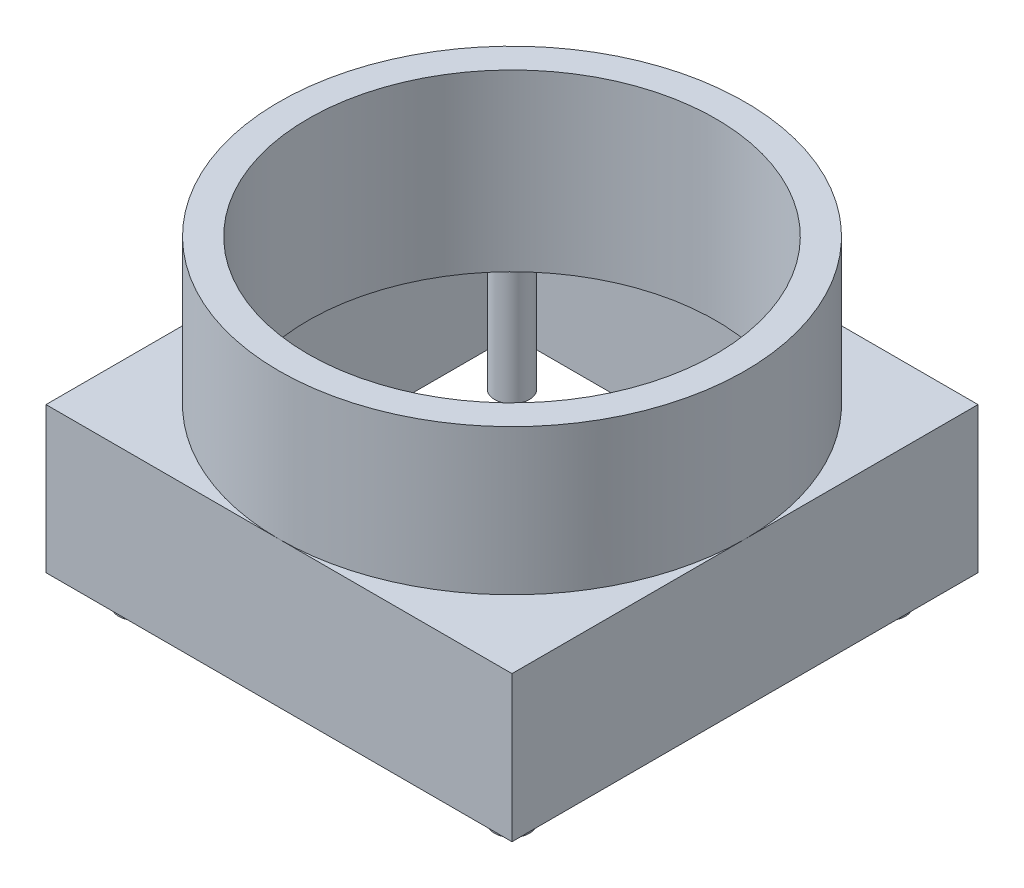
ISO-10303-21;
HEADER;
FILE_DESCRIPTION(('STEP AP214'),'2;1');
FILE_NAME('part.step','',(''),(''),'','','');
FILE_SCHEMA(('AUTOMOTIVE_DESIGN { 1 0 10303 214 1 1 1 1 }'));
ENDSEC;
DATA;
#1=APPLICATION_CONTEXT('core data for automotive mechanical design processes');
#2=APPLICATION_PROTOCOL_DEFINITION('international standard','automotive_design',2000,#1);
#3=PRODUCT_CONTEXT('',#1,'mechanical');
#4=PRODUCT('Part','Part','',(#3));
#5=PRODUCT_RELATED_PRODUCT_CATEGORY('part','',(#4));
#6=PRODUCT_DEFINITION_FORMATION('','',#4);
#7=PRODUCT_DEFINITION_CONTEXT('part definition',#1,'design');
#8=PRODUCT_DEFINITION('design','',#6,#7);
#9=PRODUCT_DEFINITION_SHAPE('','',#8);
#10=(LENGTH_UNIT() NAMED_UNIT(*) SI_UNIT(.MILLI.,.METRE.));
#11=(NAMED_UNIT(*) PLANE_ANGLE_UNIT() SI_UNIT($,.RADIAN.));
#12=(NAMED_UNIT(*) SI_UNIT($,.STERADIAN.) SOLID_ANGLE_UNIT());
#13=UNCERTAINTY_MEASURE_WITH_UNIT(LENGTH_MEASURE(1.E-05),#10,'distance_accuracy_value','');
#14=(GEOMETRIC_REPRESENTATION_CONTEXT(3) GLOBAL_UNCERTAINTY_ASSIGNED_CONTEXT((#13)) GLOBAL_UNIT_ASSIGNED_CONTEXT((#10,
#11,#12)) REPRESENTATION_CONTEXT('',''));
#15=CARTESIAN_POINT('',(0.,0.,0.));
#16=DIRECTION('',(0.,0.,1.));
#17=DIRECTION('',(1.,0.,0.));
#18=AXIS2_PLACEMENT_3D('',#15,#16,#17);
#19=CARTESIAN_POINT('',(-3.225,-0.5,-3.225));
#20=DIRECTION('',(0.,1.,0.));
#21=DIRECTION('',(0.,0.,1.));
#22=AXIS2_PLACEMENT_3D('',#19,#20,#21);
#23=CYLINDRICAL_SURFACE('',#22,0.3);
#24=CARTESIAN_POINT('',(-3.225,-0.5,-3.225));
#25=DIRECTION('',(0.,-1.,0.));
#26=DIRECTION('',(0.,0.,-1.));
#27=AXIS2_PLACEMENT_3D('',#24,#25,#26);
#28=CIRCLE('',#27,0.3);
#29=CARTESIAN_POINT('',(-3.225,-0.5,-3.525));
#30=VERTEX_POINT('',#29);
#31=EDGE_CURVE('E124',#30,#30,#28,.T.);
#32=ORIENTED_EDGE('',*,*,#31,.F.);
#33=EDGE_LOOP('',(#32));
#34=FACE_BOUND('',#33,.T.);
#35=CARTESIAN_POINT('',(-3.225,2.,-3.225));
#36=DIRECTION('',(0.,-1.,0.));
#37=DIRECTION('',(0.,0.,-1.));
#38=AXIS2_PLACEMENT_3D('',#35,#36,#37);
#39=CIRCLE('',#38,0.3);
#40=CARTESIAN_POINT('',(-3.225,2.,-3.525));
#41=VERTEX_POINT('',#40);
#42=EDGE_CURVE('E12',#41,#41,#39,.T.);
#43=ORIENTED_EDGE('',*,*,#42,.T.);
#44=EDGE_LOOP('',(#43));
#45=FACE_BOUND('',#44,.T.);
#46=ADVANCED_FACE('F120',(#34,#45),#23,.T.);
#47=CARTESIAN_POINT('',(-3.225,-0.5,-3.225));
#48=DIRECTION('',(0.,-1.,0.));
#49=DIRECTION('',(0.,0.,-1.));
#50=AXIS2_PLACEMENT_3D('',#47,#48,#49);
#51=PLANE('',#50);
#52=ORIENTED_EDGE('',*,*,#31,.T.);
#53=EDGE_LOOP('',(#52));
#54=FACE_BOUND('',#53,.T.);
#55=ADVANCED_FACE('F122',(#54),#51,.T.);
#56=CARTESIAN_POINT('',(-3.225,2.,-3.225));
#57=DIRECTION('',(0.,-1.,0.));
#58=DIRECTION('',(0.,0.,-1.));
#59=AXIS2_PLACEMENT_3D('',#56,#57,#58);
#60=PLANE('',#59);
#61=ORIENTED_EDGE('',*,*,#42,.F.);
#62=EDGE_LOOP('',(#61));
#63=FACE_BOUND('',#62,.T.);
#64=ADVANCED_FACE('F139',(#63),#60,.F.);
#65=CLOSED_SHELL('',(#46,#55,#64));
#66=MANIFOLD_SOLID_BREP('B2',#65);
#67=CARTESIAN_POINT('',(-3.225,-0.5,3.225));
#68=DIRECTION('',(0.,1.,0.));
#69=DIRECTION('',(0.,0.,1.));
#70=AXIS2_PLACEMENT_3D('',#67,#68,#69);
#71=CYLINDRICAL_SURFACE('',#70,0.3);
#72=CARTESIAN_POINT('',(-3.225,-0.5,3.225));
#73=DIRECTION('',(0.,-1.,0.));
#74=DIRECTION('',(0.,0.,-1.));
#75=AXIS2_PLACEMENT_3D('',#72,#73,#74);
#76=CIRCLE('',#75,0.3);
#77=CARTESIAN_POINT('',(-3.225,-0.5,2.925));
#78=VERTEX_POINT('',#77);
#79=EDGE_CURVE('E173',#78,#78,#76,.T.);
#80=ORIENTED_EDGE('',*,*,#79,.F.);
#81=EDGE_LOOP('',(#80));
#82=FACE_BOUND('',#81,.T.);
#83=CARTESIAN_POINT('',(-3.225,2.,3.225));
#84=DIRECTION('',(0.,-1.,0.));
#85=DIRECTION('',(0.,0.,-1.));
#86=AXIS2_PLACEMENT_3D('',#83,#84,#85);
#87=CIRCLE('',#86,0.3);
#88=CARTESIAN_POINT('',(-3.225,2.,2.925));
#89=VERTEX_POINT('',#88);
#90=EDGE_CURVE('E119',#89,#89,#87,.T.);
#91=ORIENTED_EDGE('',*,*,#90,.T.);
#92=EDGE_LOOP('',(#91));
#93=FACE_BOUND('',#92,.T.);
#94=ADVANCED_FACE('F169',(#82,#93),#71,.T.);
#95=CARTESIAN_POINT('',(0.,-0.5,0.));
#96=DIRECTION('',(0.,-1.,0.));
#97=DIRECTION('',(0.,0.,-1.));
#98=AXIS2_PLACEMENT_3D('',#95,#96,#97);
#99=PLANE('',#98);
#100=ORIENTED_EDGE('',*,*,#79,.T.);
#101=EDGE_LOOP('',(#100));
#102=FACE_BOUND('',#101,.T.);
#103=ADVANCED_FACE('F171',(#102),#99,.T.);
#104=CARTESIAN_POINT('',(0.,2.,0.));
#105=DIRECTION('',(0.,-1.,0.));
#106=DIRECTION('',(0.,0.,-1.));
#107=AXIS2_PLACEMENT_3D('',#104,#105,#106);
#108=PLANE('',#107);
#109=ORIENTED_EDGE('',*,*,#90,.F.);
#110=EDGE_LOOP('',(#109));
#111=FACE_BOUND('',#110,.T.);
#112=ADVANCED_FACE('F188',(#111),#108,.F.);
#113=CLOSED_SHELL('',(#94,#103,#112));
#114=MANIFOLD_SOLID_BREP('B7',#113);
#115=CARTESIAN_POINT('',(3.225,-0.5,3.225));
#116=DIRECTION('',(0.,1.,0.));
#117=DIRECTION('',(0.,0.,1.));
#118=AXIS2_PLACEMENT_3D('',#115,#116,#117);
#119=CYLINDRICAL_SURFACE('',#118,0.3);
#120=CARTESIAN_POINT('',(3.225,-0.5,3.225));
#121=DIRECTION('',(0.,-1.,0.));
#122=DIRECTION('',(0.,0.,-1.));
#123=AXIS2_PLACEMENT_3D('',#120,#121,#122);
#124=CIRCLE('',#123,0.3);
#125=CARTESIAN_POINT('',(3.225,-0.5,2.925));
#126=VERTEX_POINT('',#125);
#127=EDGE_CURVE('E222',#126,#126,#124,.T.);
#128=ORIENTED_EDGE('',*,*,#127,.F.);
#129=EDGE_LOOP('',(#128));
#130=FACE_BOUND('',#129,.T.);
#131=CARTESIAN_POINT('',(3.225,2.,3.225));
#132=DIRECTION('',(0.,-1.,0.));
#133=DIRECTION('',(0.,0.,-1.));
#134=AXIS2_PLACEMENT_3D('',#131,#132,#133);
#135=CIRCLE('',#134,0.3);
#136=CARTESIAN_POINT('',(3.225,2.,2.925));
#137=VERTEX_POINT('',#136);
#138=EDGE_CURVE('E168',#137,#137,#135,.T.);
#139=ORIENTED_EDGE('',*,*,#138,.T.);
#140=EDGE_LOOP('',(#139));
#141=FACE_BOUND('',#140,.T.);
#142=ADVANCED_FACE('F218',(#130,#141),#119,.T.);
#143=CARTESIAN_POINT('',(0.,-0.5,0.));
#144=DIRECTION('',(0.,-1.,0.));
#145=DIRECTION('',(0.,0.,-1.));
#146=AXIS2_PLACEMENT_3D('',#143,#144,#145);
#147=PLANE('',#146);
#148=ORIENTED_EDGE('',*,*,#127,.T.);
#149=EDGE_LOOP('',(#148));
#150=FACE_BOUND('',#149,.T.);
#151=ADVANCED_FACE('F220',(#150),#147,.T.);
#152=CARTESIAN_POINT('',(0.,2.,0.));
#153=DIRECTION('',(0.,-1.,0.));
#154=DIRECTION('',(0.,0.,-1.));
#155=AXIS2_PLACEMENT_3D('',#152,#153,#154);
#156=PLANE('',#155);
#157=ORIENTED_EDGE('',*,*,#138,.F.);
#158=EDGE_LOOP('',(#157));
#159=FACE_BOUND('',#158,.T.);
#160=ADVANCED_FACE('F237',(#159),#156,.F.);
#161=CLOSED_SHELL('',(#142,#151,#160));
#162=MANIFOLD_SOLID_BREP('B114',#161);
#163=CARTESIAN_POINT('',(3.225,-0.5,-3.225));
#164=DIRECTION('',(0.,1.,0.));
#165=DIRECTION('',(0.,0.,1.));
#166=AXIS2_PLACEMENT_3D('',#163,#164,#165);
#167=CYLINDRICAL_SURFACE('',#166,0.3);
#168=CARTESIAN_POINT('',(3.225,-0.5,-3.225));
#169=DIRECTION('',(0.,-1.,0.));
#170=DIRECTION('',(0.,0.,-1.));
#171=AXIS2_PLACEMENT_3D('',#168,#169,#170);
#172=CIRCLE('',#171,0.3);
#173=CARTESIAN_POINT('',(3.225,-0.5,-3.525));
#174=VERTEX_POINT('',#173);
#175=EDGE_CURVE('E217',#174,#174,#172,.T.);
#176=ORIENTED_EDGE('',*,*,#175,.F.);
#177=EDGE_LOOP('',(#176));
#178=FACE_BOUND('',#177,.T.);
#179=CARTESIAN_POINT('',(3.225,2.,-3.225));
#180=DIRECTION('',(0.,-1.,0.));
#181=DIRECTION('',(0.,0.,-1.));
#182=AXIS2_PLACEMENT_3D('',#179,#180,#181);
#183=CIRCLE('',#182,0.3);
#184=CARTESIAN_POINT('',(3.225,2.,-3.525));
#185=VERTEX_POINT('',#184);
#186=EDGE_CURVE('E271',#185,#185,#183,.T.);
#187=ORIENTED_EDGE('',*,*,#186,.T.);
#188=EDGE_LOOP('',(#187));
#189=FACE_BOUND('',#188,.T.);
#190=ADVANCED_FACE('F268',(#178,#189),#167,.T.);
#191=CARTESIAN_POINT('',(0.,-0.5,0.));
#192=DIRECTION('',(0.,-1.,0.));
#193=DIRECTION('',(0.,0.,-1.));
#194=AXIS2_PLACEMENT_3D('',#191,#192,#193);
#195=PLANE('',#194);
#196=ORIENTED_EDGE('',*,*,#175,.T.);
#197=EDGE_LOOP('',(#196));
#198=FACE_BOUND('',#197,.T.);
#199=ADVANCED_FACE('F283',(#198),#195,.T.);
#200=CARTESIAN_POINT('',(0.,2.,0.));
#201=DIRECTION('',(0.,-1.,0.));
#202=DIRECTION('',(0.,0.,-1.));
#203=AXIS2_PLACEMENT_3D('',#200,#201,#202);
#204=PLANE('',#203);
#205=ORIENTED_EDGE('',*,*,#186,.F.);
#206=EDGE_LOOP('',(#205));
#207=FACE_BOUND('',#206,.T.);
#208=ADVANCED_FACE('F281',(#207),#204,.F.);
#209=CLOSED_SHELL('',(#190,#199,#208));
#210=MANIFOLD_SOLID_BREP('B163',#209);
#211=CARTESIAN_POINT('',(0.,5.,0.));
#212=DIRECTION('',(0.,-1.,0.));
#213=DIRECTION('',(0.,0.,-1.));
#214=AXIS2_PLACEMENT_3D('',#211,#212,#213);
#215=CYLINDRICAL_SURFACE('',#214,4.);
#216=CARTESIAN_POINT('',(0.,5.,0.));
#217=DIRECTION('',(0.,1.,0.));
#218=DIRECTION('',(0.,0.,1.));
#219=AXIS2_PLACEMENT_3D('',#216,#217,#218);
#220=CIRCLE('',#219,4.);
#221=CARTESIAN_POINT('',(0.,5.,4.));
#222=VERTEX_POINT('',#221);
#223=EDGE_CURVE('E429',#222,#222,#220,.T.);
#224=ORIENTED_EDGE('',*,*,#223,.F.);
#225=EDGE_LOOP('',(#224));
#226=FACE_BOUND('',#225,.T.);
#227=CARTESIAN_POINT('',(0.,2.5,0.));
#228=DIRECTION('',(0.,1.,0.));
#229=DIRECTION('',(0.,0.,1.));
#230=AXIS2_PLACEMENT_3D('',#227,#228,#229);
#231=CIRCLE('',#230,4.);
#232=CARTESIAN_POINT('',(0.,2.5,4.));
#233=VERTEX_POINT('',#232);
#234=CARTESIAN_POINT('',(4.,2.5,0.));
#235=VERTEX_POINT('',#234);
#236=EDGE_CURVE('E403',#233,#235,#231,.T.);
#237=ORIENTED_EDGE('',*,*,#236,.T.);
#238=CARTESIAN_POINT('',(0.,2.5,0.));
#239=DIRECTION('',(0.,1.,0.));
#240=DIRECTION('',(0.,0.,1.));
#241=AXIS2_PLACEMENT_3D('',#238,#239,#240);
#242=CIRCLE('',#241,4.);
#243=CARTESIAN_POINT('',(0.,2.5,-4.));
#244=VERTEX_POINT('',#243);
#245=EDGE_CURVE('E396',#235,#244,#242,.T.);
#246=ORIENTED_EDGE('',*,*,#245,.T.);
#247=CARTESIAN_POINT('',(0.,2.5,0.));
#248=DIRECTION('',(0.,1.,0.));
#249=DIRECTION('',(0.,0.,1.));
#250=AXIS2_PLACEMENT_3D('',#247,#248,#249);
#251=CIRCLE('',#250,4.);
#252=CARTESIAN_POINT('',(-4.,2.5,0.));
#253=VERTEX_POINT('',#252);
#254=EDGE_CURVE('E419',#244,#253,#251,.T.);
#255=ORIENTED_EDGE('',*,*,#254,.T.);
#256=CARTESIAN_POINT('',(0.,2.5,0.));
#257=DIRECTION('',(0.,1.,0.));
#258=DIRECTION('',(0.,0.,1.));
#259=AXIS2_PLACEMENT_3D('',#256,#257,#258);
#260=CIRCLE('',#259,4.);
#261=EDGE_CURVE('E324',#233,#253,#260,.F.);
#262=ORIENTED_EDGE('',*,*,#261,.F.);
#263=EDGE_LOOP('',(#237,#246,#255,#262));
#264=FACE_BOUND('',#263,.T.);
#265=ADVANCED_FACE('F309',(#226,#264),#215,.T.);
#266=CARTESIAN_POINT('',(0.,0.,0.));
#267=DIRECTION('',(0.,1.,0.));
#268=DIRECTION('',(0.,0.,1.));
#269=AXIS2_PLACEMENT_3D('',#266,#267,#268);
#270=PLANE('',#269);
#271=DIRECTION('',(0.,0.,1.));
#272=VECTOR('',#271,1.);
#273=CARTESIAN_POINT('',(4.,0.,0.));
#274=LINE('',#273,#272);
#275=CARTESIAN_POINT('',(4.,0.,-4.));
#276=VERTEX_POINT('',#275);
#277=CARTESIAN_POINT('',(4.,0.,4.));
#278=VERTEX_POINT('',#277);
#279=EDGE_CURVE('E465',#276,#278,#274,.T.);
#280=ORIENTED_EDGE('',*,*,#279,.T.);
#281=DIRECTION('',(1.,0.,0.));
#282=VECTOR('',#281,1.);
#283=CARTESIAN_POINT('',(0.,0.,4.));
#284=LINE('',#283,#282);
#285=CARTESIAN_POINT('',(-4.,0.,4.));
#286=VERTEX_POINT('',#285);
#287=EDGE_CURVE('E473',#286,#278,#284,.T.);
#288=ORIENTED_EDGE('',*,*,#287,.F.);
#289=DIRECTION('',(0.,0.,1.));
#290=VECTOR('',#289,1.);
#291=CARTESIAN_POINT('',(-4.,0.,0.));
#292=LINE('',#291,#290);
#293=CARTESIAN_POINT('',(-4.,0.,-4.));
#294=VERTEX_POINT('',#293);
#295=EDGE_CURVE('E471',#294,#286,#292,.T.);
#296=ORIENTED_EDGE('',*,*,#295,.F.);
#297=DIRECTION('',(1.,0.,0.));
#298=VECTOR('',#297,1.);
#299=CARTESIAN_POINT('',(0.,0.,-4.));
#300=LINE('',#299,#298);
#301=EDGE_CURVE('E468',#294,#276,#300,.T.);
#302=ORIENTED_EDGE('',*,*,#301,.T.);
#303=EDGE_LOOP('',(#280,#288,#296,#302));
#304=FACE_BOUND('',#303,.T.);
#305=DIRECTION('',(0.,0.,1.));
#306=VECTOR('',#305,1.);
#307=CARTESIAN_POINT('',(-3.525,0.,-3.525));
#308=LINE('',#307,#306);
#309=CARTESIAN_POINT('',(-3.525,0.,-3.525));
#310=VERTEX_POINT('',#309);
#311=CARTESIAN_POINT('',(-3.525,0.,3.525));
#312=VERTEX_POINT('',#311);
#313=EDGE_CURVE('E432',#310,#312,#308,.T.);
#314=ORIENTED_EDGE('',*,*,#313,.T.);
#315=DIRECTION('',(1.,0.,0.));
#316=VECTOR('',#315,1.);
#317=CARTESIAN_POINT('',(-3.525,0.,3.525));
#318=LINE('',#317,#316);
#319=CARTESIAN_POINT('',(3.525,0.,3.525));
#320=VERTEX_POINT('',#319);
#321=EDGE_CURVE('E448',#312,#320,#318,.T.);
#322=ORIENTED_EDGE('',*,*,#321,.T.);
#323=DIRECTION('',(0.,0.,1.));
#324=VECTOR('',#323,1.);
#325=CARTESIAN_POINT('',(3.525,0.,-3.525));
#326=LINE('',#325,#324);
#327=CARTESIAN_POINT('',(3.525,0.,-3.525));
#328=VERTEX_POINT('',#327);
#329=EDGE_CURVE('E451',#328,#320,#326,.T.);
#330=ORIENTED_EDGE('',*,*,#329,.F.);
#331=DIRECTION('',(1.,0.,0.));
#332=VECTOR('',#331,1.);
#333=CARTESIAN_POINT('',(-3.525,0.,-3.525));
#334=LINE('',#333,#332);
#335=EDGE_CURVE('E438',#310,#328,#334,.T.);
#336=ORIENTED_EDGE('',*,*,#335,.F.);
#337=EDGE_LOOP('',(#314,#322,#330,#336));
#338=FACE_BOUND('',#337,.T.);
#339=ADVANCED_FACE('F488',(#304,#338),#270,.F.);
#340=CARTESIAN_POINT('',(4.,2.,0.));
#341=DIRECTION('',(1.,0.,0.));
#342=DIRECTION('',(0.,0.,-1.));
#343=AXIS2_PLACEMENT_3D('',#340,#341,#342);
#344=PLANE('',#343);
#345=ORIENTED_EDGE('',*,*,#279,.F.);
#346=DIRECTION('',(0.,-1.,0.));
#347=VECTOR('',#346,1.);
#348=CARTESIAN_POINT('',(4.,2.,-4.));
#349=LINE('',#348,#347);
#350=CARTESIAN_POINT('',(4.,2.5,-4.));
#351=VERTEX_POINT('',#350);
#352=EDGE_CURVE('E266',#351,#276,#349,.T.);
#353=ORIENTED_EDGE('',*,*,#352,.F.);
#354=DIRECTION('',(0.,0.,-1.));
#355=VECTOR('',#354,1.);
#356=CARTESIAN_POINT('',(4.,2.5,0.));
#357=LINE('',#356,#355);
#358=EDGE_CURVE('E388',#235,#351,#357,.T.);
#359=ORIENTED_EDGE('',*,*,#358,.F.);
#360=DIRECTION('',(0.,0.,-1.));
#361=VECTOR('',#360,1.);
#362=CARTESIAN_POINT('',(4.,2.5,0.));
#363=LINE('',#362,#361);
#364=CARTESIAN_POINT('',(4.,2.5,4.));
#365=VERTEX_POINT('',#364);
#366=EDGE_CURVE('E392',#365,#235,#363,.T.);
#367=ORIENTED_EDGE('',*,*,#366,.F.);
#368=DIRECTION('',(0.,-1.,0.));
#369=VECTOR('',#368,1.);
#370=CARTESIAN_POINT('',(4.,2.,4.));
#371=LINE('',#370,#369);
#372=EDGE_CURVE('E476',#365,#278,#371,.T.);
#373=ORIENTED_EDGE('',*,*,#372,.T.);
#374=EDGE_LOOP('',(#345,#353,#359,#367,#373));
#375=FACE_BOUND('',#374,.T.);
#376=ADVANCED_FACE('F311',(#375),#344,.T.);
#377=CARTESIAN_POINT('',(0.,2.,-4.));
#378=DIRECTION('',(0.,0.,-1.));
#379=DIRECTION('',(-1.,0.,0.));
#380=AXIS2_PLACEMENT_3D('',#377,#378,#379);
#381=PLANE('',#380);
#382=ORIENTED_EDGE('',*,*,#301,.F.);
#383=DIRECTION('',(0.,-1.,0.));
#384=VECTOR('',#383,1.);
#385=CARTESIAN_POINT('',(-4.,2.,-4.));
#386=LINE('',#385,#384);
#387=CARTESIAN_POINT('',(-4.,2.5,-4.));
#388=VERTEX_POINT('',#387);
#389=EDGE_CURVE('E317',#388,#294,#386,.T.);
#390=ORIENTED_EDGE('',*,*,#389,.F.);
#391=DIRECTION('',(-1.,0.,0.));
#392=VECTOR('',#391,1.);
#393=CARTESIAN_POINT('',(0.,2.5,-4.));
#394=LINE('',#393,#392);
#395=EDGE_CURVE('E422',#244,#388,#394,.T.);
#396=ORIENTED_EDGE('',*,*,#395,.F.);
#397=DIRECTION('',(-1.,0.,0.));
#398=VECTOR('',#397,1.);
#399=CARTESIAN_POINT('',(0.,2.5,-4.));
#400=LINE('',#399,#398);
#401=EDGE_CURVE('E395',#351,#244,#400,.T.);
#402=ORIENTED_EDGE('',*,*,#401,.F.);
#403=ORIENTED_EDGE('',*,*,#352,.T.);
#404=EDGE_LOOP('',(#382,#390,#396,#402,#403));
#405=FACE_BOUND('',#404,.T.);
#406=ADVANCED_FACE('F490',(#405),#381,.T.);
#407=CARTESIAN_POINT('',(-4.,2.,0.));
#408=DIRECTION('',(1.,0.,0.));
#409=DIRECTION('',(0.,0.,-1.));
#410=AXIS2_PLACEMENT_3D('',#407,#408,#409);
#411=PLANE('',#410);
#412=ORIENTED_EDGE('',*,*,#295,.T.);
#413=DIRECTION('',(0.,-1.,0.));
#414=VECTOR('',#413,1.);
#415=CARTESIAN_POINT('',(-4.,2.,4.));
#416=LINE('',#415,#414);
#417=CARTESIAN_POINT('',(-4.,2.5,4.));
#418=VERTEX_POINT('',#417);
#419=EDGE_CURVE('E478',#418,#286,#416,.T.);
#420=ORIENTED_EDGE('',*,*,#419,.F.);
#421=DIRECTION('',(0.,0.,1.));
#422=VECTOR('',#421,1.);
#423=CARTESIAN_POINT('',(-4.,2.5,0.));
#424=LINE('',#423,#422);
#425=EDGE_CURVE('E416',#253,#418,#424,.T.);
#426=ORIENTED_EDGE('',*,*,#425,.F.);
#427=DIRECTION('',(0.,0.,1.));
#428=VECTOR('',#427,1.);
#429=CARTESIAN_POINT('',(-4.,2.5,0.));
#430=LINE('',#429,#428);
#431=EDGE_CURVE('E332',#388,#253,#430,.T.);
#432=ORIENTED_EDGE('',*,*,#431,.F.);
#433=ORIENTED_EDGE('',*,*,#389,.T.);
#434=EDGE_LOOP('',(#412,#420,#426,#432,#433));
#435=FACE_BOUND('',#434,.T.);
#436=ADVANCED_FACE('F482',(#435),#411,.F.);
#437=CARTESIAN_POINT('',(0.,2.,4.));
#438=DIRECTION('',(0.,0.,-1.));
#439=DIRECTION('',(-1.,0.,0.));
#440=AXIS2_PLACEMENT_3D('',#437,#438,#439);
#441=PLANE('',#440);
#442=ORIENTED_EDGE('',*,*,#287,.T.);
#443=ORIENTED_EDGE('',*,*,#372,.F.);
#444=DIRECTION('',(1.,0.,0.));
#445=VECTOR('',#444,1.);
#446=CARTESIAN_POINT('',(0.,2.5,4.));
#447=LINE('',#446,#445);
#448=EDGE_CURVE('E406',#233,#365,#447,.T.);
#449=ORIENTED_EDGE('',*,*,#448,.F.);
#450=DIRECTION('',(1.,0.,0.));
#451=VECTOR('',#450,1.);
#452=CARTESIAN_POINT('',(0.,2.5,4.));
#453=LINE('',#452,#451);
#454=EDGE_CURVE('E410',#418,#233,#453,.T.);
#455=ORIENTED_EDGE('',*,*,#454,.F.);
#456=ORIENTED_EDGE('',*,*,#419,.T.);
#457=EDGE_LOOP('',(#442,#443,#449,#455,#456));
#458=FACE_BOUND('',#457,.T.);
#459=ADVANCED_FACE('F492',(#458),#441,.F.);
#460=CARTESIAN_POINT('',(-3.525,2.,-3.525));
#461=DIRECTION('',(1.,0.,0.));
#462=DIRECTION('',(0.,0.,-1.));
#463=AXIS2_PLACEMENT_3D('',#460,#461,#462);
#464=PLANE('',#463);
#465=ORIENTED_EDGE('',*,*,#313,.F.);
#466=DIRECTION('',(0.,-1.,0.));
#467=VECTOR('',#466,1.);
#468=CARTESIAN_POINT('',(-3.525,2.,-3.525));
#469=LINE('',#468,#467);
#470=CARTESIAN_POINT('',(-3.525,2.,-3.525));
#471=VERTEX_POINT('',#470);
#472=EDGE_CURVE('E445',#471,#310,#469,.T.);
#473=ORIENTED_EDGE('',*,*,#472,.F.);
#474=DIRECTION('',(0.,0.,1.));
#475=VECTOR('',#474,1.);
#476=CARTESIAN_POINT('',(-3.525,2.,-3.525));
#477=LINE('',#476,#475);
#478=CARTESIAN_POINT('',(-3.525,2.,3.525));
#479=VERTEX_POINT('',#478);
#480=EDGE_CURVE('E435',#471,#479,#477,.T.);
#481=ORIENTED_EDGE('',*,*,#480,.T.);
#482=DIRECTION('',(0.,-1.,0.));
#483=VECTOR('',#482,1.);
#484=CARTESIAN_POINT('',(-3.525,2.,3.525));
#485=LINE('',#484,#483);
#486=EDGE_CURVE('E462',#479,#312,#485,.T.);
#487=ORIENTED_EDGE('',*,*,#486,.T.);
#488=EDGE_LOOP('',(#465,#473,#481,#487));
#489=FACE_BOUND('',#488,.T.);
#490=ADVANCED_FACE('F533',(#489),#464,.T.);
#491=CARTESIAN_POINT('',(-3.525,2.,3.525));
#492=DIRECTION('',(0.,0.,-1.));
#493=DIRECTION('',(-1.,0.,0.));
#494=AXIS2_PLACEMENT_3D('',#491,#492,#493);
#495=PLANE('',#494);
#496=ORIENTED_EDGE('',*,*,#321,.F.);
#497=ORIENTED_EDGE('',*,*,#486,.F.);
#498=DIRECTION('',(1.,0.,0.));
#499=VECTOR('',#498,1.);
#500=CARTESIAN_POINT('',(-3.525,2.,3.525));
#501=LINE('',#500,#499);
#502=CARTESIAN_POINT('',(3.525,2.,3.525));
#503=VERTEX_POINT('',#502);
#504=EDGE_CURVE('E437',#479,#503,#501,.T.);
#505=ORIENTED_EDGE('',*,*,#504,.T.);
#506=DIRECTION('',(0.,-1.,0.));
#507=VECTOR('',#506,1.);
#508=CARTESIAN_POINT('',(3.525,2.,3.525));
#509=LINE('',#508,#507);
#510=EDGE_CURVE('E460',#503,#320,#509,.T.);
#511=ORIENTED_EDGE('',*,*,#510,.T.);
#512=EDGE_LOOP('',(#496,#497,#505,#511));
#513=FACE_BOUND('',#512,.T.);
#514=ADVANCED_FACE('F529',(#513),#495,.T.);
#515=CARTESIAN_POINT('',(3.525,2.,-3.525));
#516=DIRECTION('',(1.,0.,0.));
#517=DIRECTION('',(0.,0.,-1.));
#518=AXIS2_PLACEMENT_3D('',#515,#516,#517);
#519=PLANE('',#518);
#520=ORIENTED_EDGE('',*,*,#329,.T.);
#521=ORIENTED_EDGE('',*,*,#510,.F.);
#522=DIRECTION('',(0.,0.,1.));
#523=VECTOR('',#522,1.);
#524=CARTESIAN_POINT('',(3.525,2.,-3.525));
#525=LINE('',#524,#523);
#526=CARTESIAN_POINT('',(3.525,2.,-3.525));
#527=VERTEX_POINT('',#526);
#528=EDGE_CURVE('E441',#527,#503,#525,.T.);
#529=ORIENTED_EDGE('',*,*,#528,.F.);
#530=DIRECTION('',(0.,-1.,0.));
#531=VECTOR('',#530,1.);
#532=CARTESIAN_POINT('',(3.525,2.,-3.525));
#533=LINE('',#532,#531);
#534=EDGE_CURVE('E458',#527,#328,#533,.T.);
#535=ORIENTED_EDGE('',*,*,#534,.T.);
#536=EDGE_LOOP('',(#520,#521,#529,#535));
#537=FACE_BOUND('',#536,.T.);
#538=ADVANCED_FACE('F525',(#537),#519,.F.);
#539=CARTESIAN_POINT('',(-3.525,2.,-3.525));
#540=DIRECTION('',(0.,0.,-1.));
#541=DIRECTION('',(-1.,0.,0.));
#542=AXIS2_PLACEMENT_3D('',#539,#540,#541);
#543=PLANE('',#542);
#544=ORIENTED_EDGE('',*,*,#335,.T.);
#545=ORIENTED_EDGE('',*,*,#534,.F.);
#546=DIRECTION('',(1.,0.,0.));
#547=VECTOR('',#546,1.);
#548=CARTESIAN_POINT('',(-3.525,2.,-3.525));
#549=LINE('',#548,#547);
#550=EDGE_CURVE('E443',#471,#527,#549,.T.);
#551=ORIENTED_EDGE('',*,*,#550,.F.);
#552=ORIENTED_EDGE('',*,*,#472,.T.);
#553=EDGE_LOOP('',(#544,#545,#551,#552));
#554=FACE_BOUND('',#553,.T.);
#555=ADVANCED_FACE('F522',(#554),#543,.F.);
#556=CARTESIAN_POINT('',(0.,2.,0.));
#557=DIRECTION('',(0.,1.,0.));
#558=DIRECTION('',(0.,0.,1.));
#559=AXIS2_PLACEMENT_3D('',#556,#557,#558);
#560=PLANE('',#559);
#561=ORIENTED_EDGE('',*,*,#528,.T.);
#562=ORIENTED_EDGE('',*,*,#504,.F.);
#563=ORIENTED_EDGE('',*,*,#480,.F.);
#564=ORIENTED_EDGE('',*,*,#550,.T.);
#565=EDGE_LOOP('',(#561,#562,#563,#564));
#566=FACE_BOUND('',#565,.T.);
#567=CARTESIAN_POINT('',(0.,2.,0.));
#568=DIRECTION('',(0.,1.,0.));
#569=DIRECTION('',(0.,0.,1.));
#570=AXIS2_PLACEMENT_3D('',#567,#568,#569);
#571=CIRCLE('',#570,3.5);
#572=CARTESIAN_POINT('',(0.,2.,3.5));
#573=VERTEX_POINT('',#572);
#574=EDGE_CURVE('E425',#573,#573,#571,.T.);
#575=ORIENTED_EDGE('',*,*,#574,.T.);
#576=EDGE_LOOP('',(#575));
#577=FACE_BOUND('',#576,.T.);
#578=ADVANCED_FACE('F516',(#566,#577),#560,.F.);
#579=CARTESIAN_POINT('',(0.,5.,0.));
#580=DIRECTION('',(0.,-1.,0.));
#581=DIRECTION('',(0.,0.,-1.));
#582=AXIS2_PLACEMENT_3D('',#579,#580,#581);
#583=CYLINDRICAL_SURFACE('',#582,3.5);
#584=CARTESIAN_POINT('',(0.,5.,0.));
#585=DIRECTION('',(0.,1.,0.));
#586=DIRECTION('',(0.,0.,1.));
#587=AXIS2_PLACEMENT_3D('',#584,#585,#586);
#588=CIRCLE('',#587,3.5);
#589=CARTESIAN_POINT('',(0.,5.,3.5));
#590=VERTEX_POINT('',#589);
#591=EDGE_CURVE('E426',#590,#590,#588,.T.);
#592=ORIENTED_EDGE('',*,*,#591,.T.);
#593=EDGE_LOOP('',(#592));
#594=FACE_BOUND('',#593,.T.);
#595=ORIENTED_EDGE('',*,*,#574,.F.);
#596=EDGE_LOOP('',(#595));
#597=FACE_BOUND('',#596,.T.);
#598=ADVANCED_FACE('F518',(#594,#597),#583,.F.);
#599=CARTESIAN_POINT('',(0.,5.,0.));
#600=DIRECTION('',(0.,1.,0.));
#601=DIRECTION('',(0.,0.,1.));
#602=AXIS2_PLACEMENT_3D('',#599,#600,#601);
#603=PLANE('',#602);
#604=ORIENTED_EDGE('',*,*,#591,.F.);
#605=EDGE_LOOP('',(#604));
#606=FACE_BOUND('',#605,.T.);
#607=ORIENTED_EDGE('',*,*,#223,.T.);
#608=EDGE_LOOP('',(#607));
#609=FACE_BOUND('',#608,.T.);
#610=ADVANCED_FACE('F504',(#606,#609),#603,.T.);
#611=CARTESIAN_POINT('',(0.,2.5,0.));
#612=DIRECTION('',(0.,1.,0.));
#613=DIRECTION('',(0.,0.,1.));
#614=AXIS2_PLACEMENT_3D('',#611,#612,#613);
#615=PLANE('',#614);
#616=ORIENTED_EDGE('',*,*,#254,.F.);
#617=ORIENTED_EDGE('',*,*,#395,.T.);
#618=ORIENTED_EDGE('',*,*,#431,.T.);
#619=EDGE_LOOP('',(#616,#617,#618));
#620=FACE_BOUND('',#619,.T.);
#621=ADVANCED_FACE('F497',(#620),#615,.T.);
#622=CARTESIAN_POINT('',(0.,2.5,0.));
#623=DIRECTION('',(0.,1.,0.));
#624=DIRECTION('',(0.,0.,1.));
#625=AXIS2_PLACEMENT_3D('',#622,#623,#624);
#626=PLANE('',#625);
#627=ORIENTED_EDGE('',*,*,#454,.T.);
#628=ORIENTED_EDGE('',*,*,#261,.T.);
#629=ORIENTED_EDGE('',*,*,#425,.T.);
#630=EDGE_LOOP('',(#627,#628,#629));
#631=FACE_BOUND('',#630,.T.);
#632=ADVANCED_FACE('F495',(#631),#626,.T.);
#633=CARTESIAN_POINT('',(0.,2.5,0.));
#634=DIRECTION('',(0.,1.,0.));
#635=DIRECTION('',(0.,0.,1.));
#636=AXIS2_PLACEMENT_3D('',#633,#634,#635);
#637=PLANE('',#636);
#638=ORIENTED_EDGE('',*,*,#236,.F.);
#639=ORIENTED_EDGE('',*,*,#448,.T.);
#640=ORIENTED_EDGE('',*,*,#366,.T.);
#641=EDGE_LOOP('',(#638,#639,#640));
#642=FACE_BOUND('',#641,.T.);
#643=ADVANCED_FACE('F408',(#642),#637,.T.);
#644=CARTESIAN_POINT('',(0.,2.5,0.));
#645=DIRECTION('',(0.,1.,0.));
#646=DIRECTION('',(0.,0.,1.));
#647=AXIS2_PLACEMENT_3D('',#644,#645,#646);
#648=PLANE('',#647);
#649=ORIENTED_EDGE('',*,*,#245,.F.);
#650=ORIENTED_EDGE('',*,*,#358,.T.);
#651=ORIENTED_EDGE('',*,*,#401,.T.);
#652=EDGE_LOOP('',(#649,#650,#651));
#653=FACE_BOUND('',#652,.T.);
#654=ADVANCED_FACE('F399',(#653),#648,.T.);
#655=CLOSED_SHELL('',(#265,#339,#376,#406,#436,#459,#490,#514,#538,#555,#578,#598,#610,#621,
#632,#643,#654));
#656=MANIFOLD_SOLID_BREP('B212',#655);
#657=ADVANCED_BREP_SHAPE_REPRESENTATION('',(#18,#66,#114,#162,#210,#656),#14);
#658=SHAPE_DEFINITION_REPRESENTATION(#9,#657);
ENDSEC;
END-ISO-10303-21;
